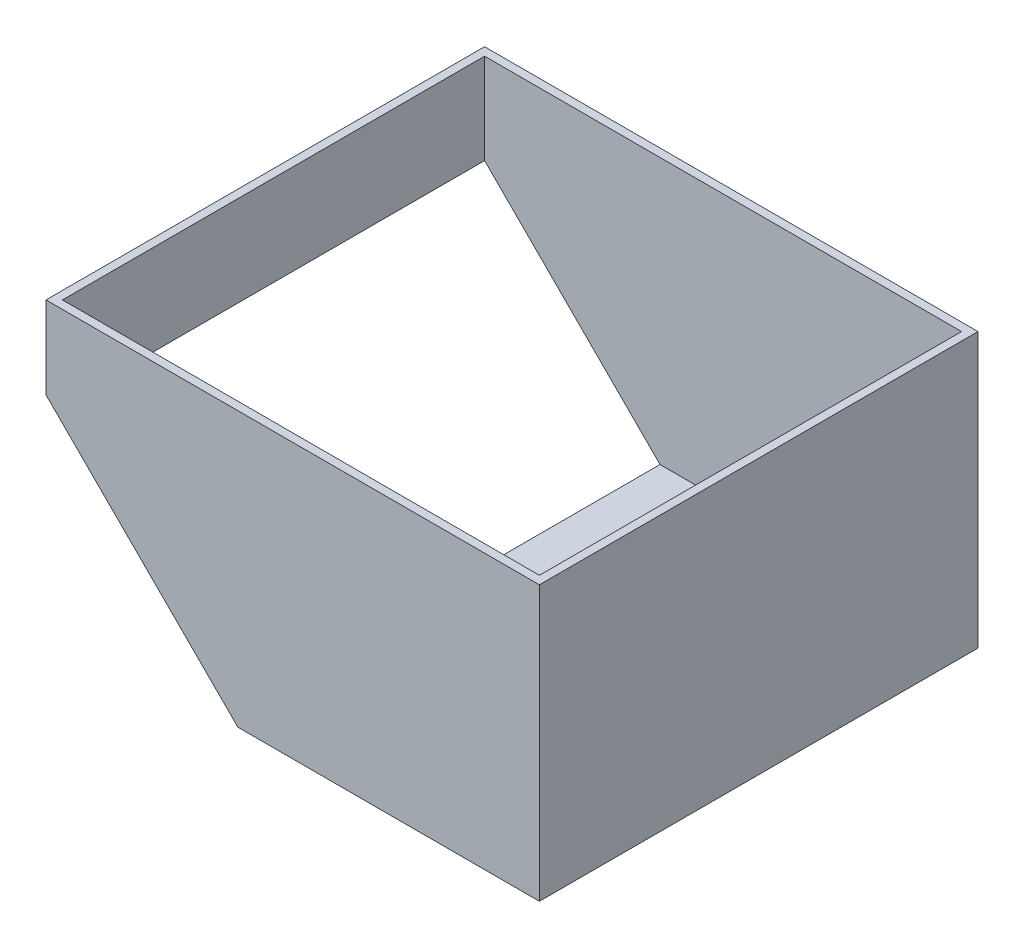
ISO-10303-21;
HEADER;
FILE_DESCRIPTION(('STEP AP214'),'2;1');
FILE_NAME('part.step','',(''),(''),'','','');
FILE_SCHEMA(('AUTOMOTIVE_DESIGN { 1 0 10303 214 1 1 1 1 }'));
ENDSEC;
DATA;
#1=APPLICATION_CONTEXT('core data for automotive mechanical design processes');
#2=APPLICATION_PROTOCOL_DEFINITION('international standard','automotive_design',2000,#1);
#3=PRODUCT_CONTEXT('',#1,'mechanical');
#4=PRODUCT('Part','Part','',(#3));
#5=PRODUCT_RELATED_PRODUCT_CATEGORY('part','',(#4));
#6=PRODUCT_DEFINITION_FORMATION('','',#4);
#7=PRODUCT_DEFINITION_CONTEXT('part definition',#1,'design');
#8=PRODUCT_DEFINITION('design','',#6,#7);
#9=PRODUCT_DEFINITION_SHAPE('','',#8);
#10=(LENGTH_UNIT() NAMED_UNIT(*) SI_UNIT(.MILLI.,.METRE.));
#11=(NAMED_UNIT(*) PLANE_ANGLE_UNIT() SI_UNIT($,.RADIAN.));
#12=(NAMED_UNIT(*) SI_UNIT($,.STERADIAN.) SOLID_ANGLE_UNIT());
#13=UNCERTAINTY_MEASURE_WITH_UNIT(LENGTH_MEASURE(1.E-05),#10,'distance_accuracy_value','');
#14=(GEOMETRIC_REPRESENTATION_CONTEXT(3) GLOBAL_UNCERTAINTY_ASSIGNED_CONTEXT((#13)) GLOBAL_UNIT_ASSIGNED_CONTEXT((#10,
#11,#12)) REPRESENTATION_CONTEXT('',''));
#15=CARTESIAN_POINT('',(0.,0.,0.));
#16=DIRECTION('',(0.,0.,1.));
#17=DIRECTION('',(1.,0.,0.));
#18=AXIS2_PLACEMENT_3D('',#15,#16,#17);
#19=CARTESIAN_POINT('',(0.,3.,0.));
#20=DIRECTION('',(1.,0.,0.));
#21=DIRECTION('',(0.,0.,-1.));
#22=AXIS2_PLACEMENT_3D('',#19,#20,#21);
#23=PLANE('',#22);
#24=DIRECTION('',(0.,-1.,0.));
#25=VECTOR('',#24,1.);
#26=CARTESIAN_POINT('',(0.,3.,-160.));
#27=LINE('',#26,#25);
#28=CARTESIAN_POINT('',(0.,100.,-160.));
#29=VERTEX_POINT('',#28);
#30=CARTESIAN_POINT('',(0.,70.,-160.));
#31=VERTEX_POINT('',#30);
#32=EDGE_CURVE('E120',#29,#31,#27,.T.);
#33=ORIENTED_EDGE('',*,*,#32,.T.);
#34=DIRECTION('',(0.,0.,1.));
#35=VECTOR('',#34,1.);
#36=CARTESIAN_POINT('',(0.,70.,-160.));
#37=LINE('',#36,#35);
#38=CARTESIAN_POINT('',(0.,70.,0.));
#39=VERTEX_POINT('',#38);
#40=EDGE_CURVE('E106',#31,#39,#37,.T.);
#41=ORIENTED_EDGE('',*,*,#40,.T.);
#42=DIRECTION('',(0.,-1.,0.));
#43=VECTOR('',#42,1.);
#44=CARTESIAN_POINT('',(0.,3.,0.));
#45=LINE('',#44,#43);
#46=CARTESIAN_POINT('',(0.,100.,0.));
#47=VERTEX_POINT('',#46);
#48=EDGE_CURVE('E40',#47,#39,#45,.T.);
#49=ORIENTED_EDGE('',*,*,#48,.F.);
#50=DIRECTION('',(0.,0.,1.));
#51=VECTOR('',#50,1.);
#52=CARTESIAN_POINT('',(0.,100.,0.));
#53=LINE('',#52,#51);
#54=EDGE_CURVE('E128',#29,#47,#53,.T.);
#55=ORIENTED_EDGE('',*,*,#54,.F.);
#56=EDGE_LOOP('',(#33,#41,#49,#55));
#57=FACE_BOUND('',#56,.T.);
#58=ADVANCED_FACE('F33',(#57),#23,.F.);
#59=CARTESIAN_POINT('',(0.,3.,0.));
#60=DIRECTION('',(0.,0.,-1.));
#61=DIRECTION('',(-1.,0.,0.));
#62=AXIS2_PLACEMENT_3D('',#59,#60,#61);
#63=PLANE('',#62);
#64=ORIENTED_EDGE('',*,*,#48,.T.);
#65=DIRECTION('',(0.707106781186552,-0.707106781186544,0.));
#66=VECTOR('',#65,1.);
#67=CARTESIAN_POINT('',(33.5,36.5000000000004,0.));
#68=LINE('',#67,#66);
#69=CARTESIAN_POINT('',(70.0000000000008,0.,0.));
#70=VERTEX_POINT('',#69);
#71=EDGE_CURVE('E109',#39,#70,#68,.T.);
#72=ORIENTED_EDGE('',*,*,#71,.T.);
#73=DIRECTION('',(1.,0.,0.));
#74=VECTOR('',#73,1.);
#75=CARTESIAN_POINT('',(0.,0.,0.));
#76=LINE('',#75,#74);
#77=CARTESIAN_POINT('',(180.,0.,0.));
#78=VERTEX_POINT('',#77);
#79=EDGE_CURVE('E164',#70,#78,#76,.T.);
#80=ORIENTED_EDGE('',*,*,#79,.T.);
#81=DIRECTION('',(0.,-1.,0.));
#82=VECTOR('',#81,1.);
#83=CARTESIAN_POINT('',(180.,3.,0.));
#84=LINE('',#83,#82);
#85=CARTESIAN_POINT('',(180.,100.,0.));
#86=VERTEX_POINT('',#85);
#87=EDGE_CURVE('E131',#86,#78,#84,.T.);
#88=ORIENTED_EDGE('',*,*,#87,.F.);
#89=DIRECTION('',(1.,0.,0.));
#90=VECTOR('',#89,1.);
#91=CARTESIAN_POINT('',(180.,100.,0.));
#92=LINE('',#91,#90);
#93=EDGE_CURVE('E143',#47,#86,#92,.T.);
#94=ORIENTED_EDGE('',*,*,#93,.F.);
#95=EDGE_LOOP('',(#64,#72,#80,#88,#94));
#96=FACE_BOUND('',#95,.T.);
#97=ADVANCED_FACE('F140',(#96),#63,.F.);
#98=CARTESIAN_POINT('',(180.,3.,0.));
#99=DIRECTION('',(-1.,0.,0.));
#100=DIRECTION('',(0.,0.,1.));
#101=AXIS2_PLACEMENT_3D('',#98,#99,#100);
#102=PLANE('',#101);
#103=DIRECTION('',(0.,0.,-1.));
#104=VECTOR('',#103,1.);
#105=CARTESIAN_POINT('',(180.,0.,0.));
#106=LINE('',#105,#104);
#107=CARTESIAN_POINT('',(180.,0.,-160.));
#108=VERTEX_POINT('',#107);
#109=EDGE_CURVE('E133',#78,#108,#106,.T.);
#110=ORIENTED_EDGE('',*,*,#109,.T.);
#111=DIRECTION('',(0.,-1.,0.));
#112=VECTOR('',#111,1.);
#113=CARTESIAN_POINT('',(180.,3.,-160.));
#114=LINE('',#113,#112);
#115=CARTESIAN_POINT('',(180.,100.,-160.));
#116=VERTEX_POINT('',#115);
#117=EDGE_CURVE('E129',#116,#108,#114,.T.);
#118=ORIENTED_EDGE('',*,*,#117,.F.);
#119=DIRECTION('',(0.,0.,-1.));
#120=VECTOR('',#119,1.);
#121=CARTESIAN_POINT('',(180.,100.,0.));
#122=LINE('',#121,#120);
#123=EDGE_CURVE('E153',#86,#116,#122,.T.);
#124=ORIENTED_EDGE('',*,*,#123,.F.);
#125=ORIENTED_EDGE('',*,*,#87,.T.);
#126=EDGE_LOOP('',(#110,#118,#124,#125));
#127=FACE_BOUND('',#126,.T.);
#128=ADVANCED_FACE('F167',(#127),#102,.F.);
#129=CARTESIAN_POINT('',(0.,3.,-160.));
#130=DIRECTION('',(0.,0.,1.));
#131=DIRECTION('',(1.,0.,0.));
#132=AXIS2_PLACEMENT_3D('',#129,#130,#131);
#133=PLANE('',#132);
#134=DIRECTION('',(-1.,0.,0.));
#135=VECTOR('',#134,1.);
#136=CARTESIAN_POINT('',(0.,0.,-160.));
#137=LINE('',#136,#135);
#138=CARTESIAN_POINT('',(70.0000000000008,0.,-160.));
#139=VERTEX_POINT('',#138);
#140=EDGE_CURVE('E124',#108,#139,#137,.T.);
#141=ORIENTED_EDGE('',*,*,#140,.T.);
#142=DIRECTION('',(-0.707106781186552,0.707106781186544,0.));
#143=VECTOR('',#142,1.);
#144=CARTESIAN_POINT('',(0.,70.,-160.));
#145=LINE('',#144,#143);
#146=EDGE_CURVE('E47',#139,#31,#145,.T.);
#147=ORIENTED_EDGE('',*,*,#146,.T.);
#148=ORIENTED_EDGE('',*,*,#32,.F.);
#149=DIRECTION('',(-1.,0.,0.));
#150=VECTOR('',#149,1.);
#151=CARTESIAN_POINT('',(180.,100.,-160.));
#152=LINE('',#151,#150);
#153=EDGE_CURVE('E149',#116,#29,#152,.T.);
#154=ORIENTED_EDGE('',*,*,#153,.F.);
#155=ORIENTED_EDGE('',*,*,#117,.T.);
#156=EDGE_LOOP('',(#141,#147,#148,#154,#155));
#157=FACE_BOUND('',#156,.T.);
#158=ADVANCED_FACE('F118',(#157),#133,.F.);
#159=CARTESIAN_POINT('',(0.,0.,0.));
#160=DIRECTION('',(0.,-1.,0.));
#161=DIRECTION('',(0.,0.,-1.));
#162=AXIS2_PLACEMENT_3D('',#159,#160,#161);
#163=PLANE('',#162);
#164=DIRECTION('',(0.,0.,1.));
#165=VECTOR('',#164,1.);
#166=CARTESIAN_POINT('',(70.0000000000008,0.,-160.));
#167=LINE('',#166,#165);
#168=EDGE_CURVE('E114',#139,#70,#167,.T.);
#169=ORIENTED_EDGE('',*,*,#168,.F.);
#170=ORIENTED_EDGE('',*,*,#140,.F.);
#171=ORIENTED_EDGE('',*,*,#109,.F.);
#172=ORIENTED_EDGE('',*,*,#79,.F.);
#173=EDGE_LOOP('',(#169,#170,#171,#172));
#174=FACE_BOUND('',#173,.T.);
#175=ADVANCED_FACE('F169',(#174),#163,.T.);
#176=CARTESIAN_POINT('',(177.,100.,-3.));
#177=DIRECTION('',(0.,0.,-1.));
#178=DIRECTION('',(-1.,0.,0.));
#179=AXIS2_PLACEMENT_3D('',#176,#177,#178);
#180=PLANE('',#179);
#181=DIRECTION('',(0.707106781186552,-0.707106781186544,0.));
#182=VECTOR('',#181,1.);
#183=CARTESIAN_POINT('',(73.500000000001,-3.50000000000016,-3.));
#184=LINE('',#183,#182);
#185=CARTESIAN_POINT('',(3.,67.0000000000001,-3.));
#186=VERTEX_POINT('',#185);
#187=CARTESIAN_POINT('',(67.0000000000008,3.,-3.));
#188=VERTEX_POINT('',#187);
#189=EDGE_CURVE('E55',#186,#188,#184,.T.);
#190=ORIENTED_EDGE('',*,*,#189,.F.);
#191=DIRECTION('',(0.,-1.,0.));
#192=VECTOR('',#191,1.);
#193=CARTESIAN_POINT('',(3.,100.,-3.));
#194=LINE('',#193,#192);
#195=CARTESIAN_POINT('',(3.,100.,-3.));
#196=VERTEX_POINT('',#195);
#197=EDGE_CURVE('E186',#196,#186,#194,.T.);
#198=ORIENTED_EDGE('',*,*,#197,.F.);
#199=DIRECTION('',(1.,0.,0.));
#200=VECTOR('',#199,1.);
#201=CARTESIAN_POINT('',(177.,100.,-3.));
#202=LINE('',#201,#200);
#203=CARTESIAN_POINT('',(177.,100.,-3.));
#204=VERTEX_POINT('',#203);
#205=EDGE_CURVE('E177',#196,#204,#202,.T.);
#206=ORIENTED_EDGE('',*,*,#205,.T.);
#207=DIRECTION('',(0.,-1.,0.));
#208=VECTOR('',#207,1.);
#209=CARTESIAN_POINT('',(177.,100.,-3.));
#210=LINE('',#209,#208);
#211=CARTESIAN_POINT('',(177.,3.,-3.));
#212=VERTEX_POINT('',#211);
#213=EDGE_CURVE('E195',#204,#212,#210,.T.);
#214=ORIENTED_EDGE('',*,*,#213,.T.);
#215=DIRECTION('',(1.,0.,0.));
#216=VECTOR('',#215,1.);
#217=CARTESIAN_POINT('',(0.,3.,-3.));
#218=LINE('',#217,#216);
#219=EDGE_CURVE('E162',#188,#212,#218,.T.);
#220=ORIENTED_EDGE('',*,*,#219,.F.);
#221=EDGE_LOOP('',(#190,#198,#206,#214,#220));
#222=FACE_BOUND('',#221,.T.);
#223=ADVANCED_FACE('F200',(#222),#180,.T.);
#224=CARTESIAN_POINT('',(177.,100.,-3.));
#225=DIRECTION('',(-1.,0.,0.));
#226=DIRECTION('',(0.,0.,1.));
#227=AXIS2_PLACEMENT_3D('',#224,#225,#226);
#228=PLANE('',#227);
#229=DIRECTION('',(0.,0.,-1.));
#230=VECTOR('',#229,1.);
#231=CARTESIAN_POINT('',(177.,3.,0.));
#232=LINE('',#231,#230);
#233=CARTESIAN_POINT('',(177.,3.,-157.));
#234=VERTEX_POINT('',#233);
#235=EDGE_CURVE('E159',#212,#234,#232,.T.);
#236=ORIENTED_EDGE('',*,*,#235,.F.);
#237=ORIENTED_EDGE('',*,*,#213,.F.);
#238=DIRECTION('',(0.,0.,-1.));
#239=VECTOR('',#238,1.);
#240=CARTESIAN_POINT('',(177.,100.,-3.));
#241=LINE('',#240,#239);
#242=CARTESIAN_POINT('',(177.,100.,-157.));
#243=VERTEX_POINT('',#242);
#244=EDGE_CURVE('E179',#204,#243,#241,.T.);
#245=ORIENTED_EDGE('',*,*,#244,.T.);
#246=DIRECTION('',(0.,-1.,0.));
#247=VECTOR('',#246,1.);
#248=CARTESIAN_POINT('',(177.,100.,-157.));
#249=LINE('',#248,#247);
#250=EDGE_CURVE('E192',#243,#234,#249,.T.);
#251=ORIENTED_EDGE('',*,*,#250,.T.);
#252=EDGE_LOOP('',(#236,#237,#245,#251));
#253=FACE_BOUND('',#252,.T.);
#254=ADVANCED_FACE('F206',(#253),#228,.T.);
#255=CARTESIAN_POINT('',(177.,100.,-157.));
#256=DIRECTION('',(0.,0.,1.));
#257=DIRECTION('',(1.,0.,0.));
#258=AXIS2_PLACEMENT_3D('',#255,#256,#257);
#259=PLANE('',#258);
#260=DIRECTION('',(-0.707106781186552,0.707106781186544,0.));
#261=VECTOR('',#260,1.);
#262=CARTESIAN_POINT('',(73.500000000001,-3.50000000000016,-157.));
#263=LINE('',#262,#261);
#264=CARTESIAN_POINT('',(67.0000000000008,3.,-157.));
#265=VERTEX_POINT('',#264);
#266=CARTESIAN_POINT('',(3.,67.0000000000001,-157.));
#267=VERTEX_POINT('',#266);
#268=EDGE_CURVE('E113',#265,#267,#263,.T.);
#269=ORIENTED_EDGE('',*,*,#268,.F.);
#270=DIRECTION('',(-1.,0.,0.));
#271=VECTOR('',#270,1.);
#272=CARTESIAN_POINT('',(0.,3.,-157.));
#273=LINE('',#272,#271);
#274=EDGE_CURVE('E151',#234,#265,#273,.T.);
#275=ORIENTED_EDGE('',*,*,#274,.F.);
#276=ORIENTED_EDGE('',*,*,#250,.F.);
#277=DIRECTION('',(-1.,0.,0.));
#278=VECTOR('',#277,1.);
#279=CARTESIAN_POINT('',(177.,100.,-157.));
#280=LINE('',#279,#278);
#281=CARTESIAN_POINT('',(3.,100.,-157.));
#282=VERTEX_POINT('',#281);
#283=EDGE_CURVE('E181',#243,#282,#280,.T.);
#284=ORIENTED_EDGE('',*,*,#283,.T.);
#285=DIRECTION('',(0.,-1.,0.));
#286=VECTOR('',#285,1.);
#287=CARTESIAN_POINT('',(3.,100.,-157.));
#288=LINE('',#287,#286);
#289=EDGE_CURVE('E189',#282,#267,#288,.T.);
#290=ORIENTED_EDGE('',*,*,#289,.T.);
#291=EDGE_LOOP('',(#269,#275,#276,#284,#290));
#292=FACE_BOUND('',#291,.T.);
#293=ADVANCED_FACE('F212',(#292),#259,.T.);
#294=CARTESIAN_POINT('',(3.,100.,-3.));
#295=DIRECTION('',(1.,0.,0.));
#296=DIRECTION('',(0.,0.,-1.));
#297=AXIS2_PLACEMENT_3D('',#294,#295,#296);
#298=PLANE('',#297);
#299=DIRECTION('',(0.,0.,1.));
#300=VECTOR('',#299,1.);
#301=CARTESIAN_POINT('',(3.,67.,-3.));
#302=LINE('',#301,#300);
#303=EDGE_CURVE('E174',#267,#186,#302,.T.);
#304=ORIENTED_EDGE('',*,*,#303,.F.);
#305=ORIENTED_EDGE('',*,*,#289,.F.);
#306=DIRECTION('',(0.,0.,1.));
#307=VECTOR('',#306,1.);
#308=CARTESIAN_POINT('',(3.,100.,-3.));
#309=LINE('',#308,#307);
#310=EDGE_CURVE('E184',#282,#196,#309,.T.);
#311=ORIENTED_EDGE('',*,*,#310,.T.);
#312=ORIENTED_EDGE('',*,*,#197,.T.);
#313=EDGE_LOOP('',(#304,#305,#311,#312));
#314=FACE_BOUND('',#313,.T.);
#315=ADVANCED_FACE('F217',(#314),#298,.T.);
#316=CARTESIAN_POINT('',(0.,100.,0.));
#317=DIRECTION('',(0.,1.,0.));
#318=DIRECTION('',(0.,0.,1.));
#319=AXIS2_PLACEMENT_3D('',#316,#317,#318);
#320=PLANE('',#319);
#321=ORIENTED_EDGE('',*,*,#123,.T.);
#322=ORIENTED_EDGE('',*,*,#153,.T.);
#323=ORIENTED_EDGE('',*,*,#54,.T.);
#324=ORIENTED_EDGE('',*,*,#93,.T.);
#325=EDGE_LOOP('',(#321,#322,#323,#324));
#326=FACE_BOUND('',#325,.T.);
#327=ORIENTED_EDGE('',*,*,#244,.F.);
#328=ORIENTED_EDGE('',*,*,#205,.F.);
#329=ORIENTED_EDGE('',*,*,#310,.F.);
#330=ORIENTED_EDGE('',*,*,#283,.F.);
#331=EDGE_LOOP('',(#327,#328,#329,#330));
#332=FACE_BOUND('',#331,.T.);
#333=ADVANCED_FACE('F146',(#326,#332),#320,.T.);
#334=CARTESIAN_POINT('',(0.,3.,0.));
#335=DIRECTION('',(0.,-1.,0.));
#336=DIRECTION('',(0.,0.,-1.));
#337=AXIS2_PLACEMENT_3D('',#334,#335,#336);
#338=PLANE('',#337);
#339=ORIENTED_EDGE('',*,*,#274,.T.);
#340=DIRECTION('',(0.,0.,1.));
#341=VECTOR('',#340,1.);
#342=CARTESIAN_POINT('',(67.0000000000008,3.,0.));
#343=LINE('',#342,#341);
#344=EDGE_CURVE('E11',#265,#188,#343,.T.);
#345=ORIENTED_EDGE('',*,*,#344,.T.);
#346=ORIENTED_EDGE('',*,*,#219,.T.);
#347=ORIENTED_EDGE('',*,*,#235,.T.);
#348=EDGE_LOOP('',(#339,#345,#346,#347));
#349=FACE_BOUND('',#348,.T.);
#350=ADVANCED_FACE('F214',(#349),#338,.F.);
#351=CARTESIAN_POINT('',(0.,70.,-160.));
#352=DIRECTION('',(0.707106781186544,0.707106781186552,0.));
#353=DIRECTION('',(-0.707106781186552,0.707106781186544,0.));
#354=AXIS2_PLACEMENT_3D('',#351,#352,#353);
#355=PLANE('',#354);
#356=ORIENTED_EDGE('',*,*,#303,.T.);
#357=ORIENTED_EDGE('',*,*,#189,.T.);
#358=ORIENTED_EDGE('',*,*,#344,.F.);
#359=ORIENTED_EDGE('',*,*,#268,.T.);
#360=EDGE_LOOP('',(#356,#357,#358,#359));
#361=FACE_BOUND('',#360,.T.);
#362=ORIENTED_EDGE('',*,*,#40,.F.);
#363=ORIENTED_EDGE('',*,*,#146,.F.);
#364=ORIENTED_EDGE('',*,*,#168,.T.);
#365=ORIENTED_EDGE('',*,*,#71,.F.);
#366=EDGE_LOOP('',(#362,#363,#364,#365));
#367=FACE_BOUND('',#366,.T.);
#368=ADVANCED_FACE('F107',(#361,#367),#355,.F.);
#369=CLOSED_SHELL('',(#58,#97,#128,#158,#175,#223,#254,#293,#315,#333,#350,#368));
#370=MANIFOLD_SOLID_BREP('B2',#369);
#371=ADVANCED_BREP_SHAPE_REPRESENTATION('',(#18,#370),#14);
#372=SHAPE_DEFINITION_REPRESENTATION(#9,#371);
ENDSEC;
END-ISO-10303-21;
